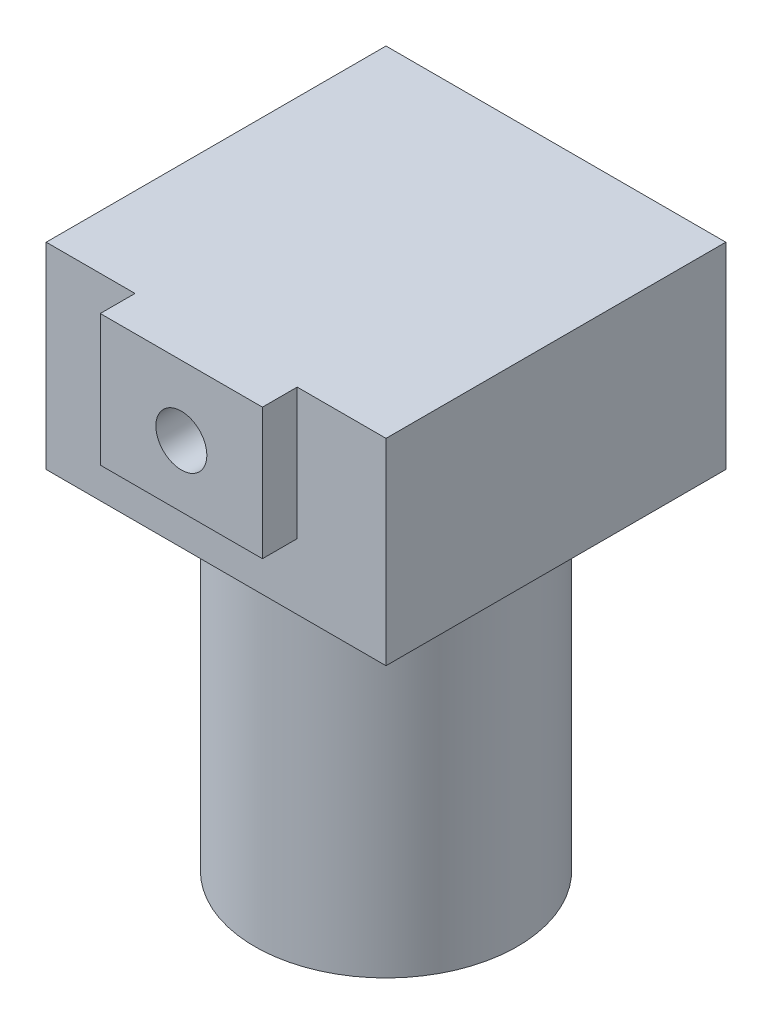
ISO-10303-21;
HEADER;
FILE_DESCRIPTION(('STEP AP214'),'2;1');
FILE_NAME('part.step','',(''),(''),'','','');
FILE_SCHEMA(('AUTOMOTIVE_DESIGN { 1 0 10303 214 1 1 1 1 }'));
ENDSEC;
DATA;
#1=APPLICATION_CONTEXT('core data for automotive mechanical design processes');
#2=APPLICATION_PROTOCOL_DEFINITION('international standard','automotive_design',2000,#1);
#3=PRODUCT_CONTEXT('',#1,'mechanical');
#4=PRODUCT('Part','Part','',(#3));
#5=PRODUCT_RELATED_PRODUCT_CATEGORY('part','',(#4));
#6=PRODUCT_DEFINITION_FORMATION('','',#4);
#7=PRODUCT_DEFINITION_CONTEXT('part definition',#1,'design');
#8=PRODUCT_DEFINITION('design','',#6,#7);
#9=PRODUCT_DEFINITION_SHAPE('','',#8);
#10=(LENGTH_UNIT() NAMED_UNIT(*) SI_UNIT(.MILLI.,.METRE.));
#11=(NAMED_UNIT(*) PLANE_ANGLE_UNIT() SI_UNIT($,.RADIAN.));
#12=(NAMED_UNIT(*) SI_UNIT($,.STERADIAN.) SOLID_ANGLE_UNIT());
#13=UNCERTAINTY_MEASURE_WITH_UNIT(LENGTH_MEASURE(1.E-05),#10,'distance_accuracy_value','');
#14=(GEOMETRIC_REPRESENTATION_CONTEXT(3) GLOBAL_UNCERTAINTY_ASSIGNED_CONTEXT((#13)) GLOBAL_UNIT_ASSIGNED_CONTEXT((#10,
#11,#12)) REPRESENTATION_CONTEXT('',''));
#15=CARTESIAN_POINT('',(0.,0.,0.));
#16=DIRECTION('',(0.,0.,1.));
#17=DIRECTION('',(1.,0.,0.));
#18=AXIS2_PLACEMENT_3D('',#15,#16,#17);
#19=CARTESIAN_POINT('',(0.,25.5,0.));
#20=DIRECTION('',(1.,0.,0.));
#21=DIRECTION('',(0.,0.,-1.));
#22=AXIS2_PLACEMENT_3D('',#19,#20,#21);
#23=PLANE('',#22);
#24=DIRECTION('',(0.,-1.,0.));
#25=VECTOR('',#24,1.);
#26=CARTESIAN_POINT('',(0.,0.,-4.5));
#27=LINE('',#26,#25);
#28=CARTESIAN_POINT('',(0.,25.5,-4.5));
#29=VERTEX_POINT('',#28);
#30=CARTESIAN_POINT('',(0.,0.,-4.5));
#31=VERTEX_POINT('',#30);
#32=EDGE_CURVE('E47',#29,#31,#27,.T.);
#33=ORIENTED_EDGE('',*,*,#32,.F.);
#34=DIRECTION('',(0.,0.,1.));
#35=VECTOR('',#34,1.);
#36=CARTESIAN_POINT('',(0.,25.5,0.));
#37=LINE('',#36,#35);
#38=CARTESIAN_POINT('',(0.,25.5,-48.5));
#39=VERTEX_POINT('',#38);
#40=EDGE_CURVE('E78',#39,#29,#37,.T.);
#41=ORIENTED_EDGE('',*,*,#40,.F.);
#42=DIRECTION('',(0.,-1.,0.));
#43=VECTOR('',#42,1.);
#44=CARTESIAN_POINT('',(0.,25.5,-48.5));
#45=LINE('',#44,#43);
#46=CARTESIAN_POINT('',(0.,0.,-48.5));
#47=VERTEX_POINT('',#46);
#48=EDGE_CURVE('E72',#39,#47,#45,.T.);
#49=ORIENTED_EDGE('',*,*,#48,.T.);
#50=DIRECTION('',(0.,0.,1.));
#51=VECTOR('',#50,1.);
#52=CARTESIAN_POINT('',(0.,0.,0.));
#53=LINE('',#52,#51);
#54=EDGE_CURVE('E83',#47,#31,#53,.T.);
#55=ORIENTED_EDGE('',*,*,#54,.T.);
#56=EDGE_LOOP('',(#33,#41,#49,#55));
#57=FACE_BOUND('',#56,.T.);
#58=ADVANCED_FACE('F32',(#57),#23,.F.);
#59=CARTESIAN_POINT('',(0.,25.5,0.));
#60=DIRECTION('',(0.,0.,-1.));
#61=DIRECTION('',(-1.,0.,0.));
#62=AXIS2_PLACEMENT_3D('',#59,#60,#61);
#63=PLANE('',#62);
#64=CARTESIAN_POINT('',(22.,16.5,0.));
#65=DIRECTION('',(0.,0.,1.));
#66=DIRECTION('',(1.,0.,0.));
#67=AXIS2_PLACEMENT_3D('',#64,#65,#66);
#68=CIRCLE('',#67,3.3);
#69=CARTESIAN_POINT('',(25.3,16.5,0.));
#70=VERTEX_POINT('',#69);
#71=EDGE_CURVE('E136',#70,#70,#68,.T.);
#72=ORIENTED_EDGE('',*,*,#71,.F.);
#73=EDGE_LOOP('',(#72));
#74=FACE_BOUND('',#73,.T.);
#75=DIRECTION('',(0.,-1.,0.));
#76=VECTOR('',#75,1.);
#77=CARTESIAN_POINT('',(11.5,0.,0.));
#78=LINE('',#77,#76);
#79=CARTESIAN_POINT('',(11.5,25.5,0.));
#80=VERTEX_POINT('',#79);
#81=CARTESIAN_POINT('',(11.5,8.5,0.));
#82=VERTEX_POINT('',#81);
#83=EDGE_CURVE('E109',#80,#82,#78,.T.);
#84=ORIENTED_EDGE('',*,*,#83,.T.);
#85=DIRECTION('',(1.,0.,0.));
#86=VECTOR('',#85,1.);
#87=CARTESIAN_POINT('',(0.,8.49999999999999,0.));
#88=LINE('',#87,#86);
#89=CARTESIAN_POINT('',(32.5,8.5,0.));
#90=VERTEX_POINT('',#89);
#91=EDGE_CURVE('E113',#82,#90,#88,.T.);
#92=ORIENTED_EDGE('',*,*,#91,.T.);
#93=DIRECTION('',(0.,-1.,0.));
#94=VECTOR('',#93,1.);
#95=CARTESIAN_POINT('',(32.5,0.,0.));
#96=LINE('',#95,#94);
#97=CARTESIAN_POINT('',(32.5,25.5,0.));
#98=VERTEX_POINT('',#97);
#99=EDGE_CURVE('E116',#98,#90,#96,.T.);
#100=ORIENTED_EDGE('',*,*,#99,.F.);
#101=DIRECTION('',(1.,0.,0.));
#102=VECTOR('',#101,1.);
#103=CARTESIAN_POINT('',(0.,25.5,0.));
#104=LINE('',#103,#102);
#105=EDGE_CURVE('E96',#80,#98,#104,.T.);
#106=ORIENTED_EDGE('',*,*,#105,.F.);
#107=EDGE_LOOP('',(#84,#92,#100,#106));
#108=FACE_BOUND('',#107,.T.);
#109=ADVANCED_FACE('F166',(#74,#108),#63,.F.);
#110=CARTESIAN_POINT('',(44.,25.5,0.));
#111=DIRECTION('',(-1.,0.,0.));
#112=DIRECTION('',(0.,0.,1.));
#113=AXIS2_PLACEMENT_3D('',#110,#111,#112);
#114=PLANE('',#113);
#115=DIRECTION('',(0.,1.,0.));
#116=VECTOR('',#115,1.);
#117=CARTESIAN_POINT('',(44.,0.,-4.5));
#118=LINE('',#117,#116);
#119=CARTESIAN_POINT('',(44.,0.,-4.5));
#120=VERTEX_POINT('',#119);
#121=CARTESIAN_POINT('',(44.,25.5,-4.5));
#122=VERTEX_POINT('',#121);
#123=EDGE_CURVE('E104',#120,#122,#118,.T.);
#124=ORIENTED_EDGE('',*,*,#123,.F.);
#125=DIRECTION('',(0.,0.,-1.));
#126=VECTOR('',#125,1.);
#127=CARTESIAN_POINT('',(44.,0.,0.));
#128=LINE('',#127,#126);
#129=CARTESIAN_POINT('',(44.,0.,-48.5));
#130=VERTEX_POINT('',#129);
#131=EDGE_CURVE('E79',#120,#130,#128,.T.);
#132=ORIENTED_EDGE('',*,*,#131,.T.);
#133=DIRECTION('',(0.,-1.,0.));
#134=VECTOR('',#133,1.);
#135=CARTESIAN_POINT('',(44.,25.5,-48.5));
#136=LINE('',#135,#134);
#137=CARTESIAN_POINT('',(44.,25.5,-48.5));
#138=VERTEX_POINT('',#137);
#139=EDGE_CURVE('E35',#138,#130,#136,.T.);
#140=ORIENTED_EDGE('',*,*,#139,.F.);
#141=DIRECTION('',(0.,0.,-1.));
#142=VECTOR('',#141,1.);
#143=CARTESIAN_POINT('',(44.,25.5,0.));
#144=LINE('',#143,#142);
#145=EDGE_CURVE('E94',#122,#138,#144,.T.);
#146=ORIENTED_EDGE('',*,*,#145,.F.);
#147=EDGE_LOOP('',(#124,#132,#140,#146));
#148=FACE_BOUND('',#147,.T.);
#149=ADVANCED_FACE('F163',(#148),#114,.F.);
#150=CARTESIAN_POINT('',(0.,25.5,0.));
#151=DIRECTION('',(0.,-1.,0.));
#152=DIRECTION('',(0.,0.,-1.));
#153=AXIS2_PLACEMENT_3D('',#150,#151,#152);
#154=PLANE('',#153);
#155=ORIENTED_EDGE('',*,*,#105,.T.);
#156=DIRECTION('',(0.,0.,1.));
#157=VECTOR('',#156,1.);
#158=CARTESIAN_POINT('',(32.5,25.5,-4.5));
#159=LINE('',#158,#157);
#160=CARTESIAN_POINT('',(32.5,25.5,-4.5));
#161=VERTEX_POINT('',#160);
#162=EDGE_CURVE('E100',#161,#98,#159,.T.);
#163=ORIENTED_EDGE('',*,*,#162,.F.);
#164=DIRECTION('',(-1.,0.,0.));
#165=VECTOR('',#164,1.);
#166=CARTESIAN_POINT('',(0.,25.5,-4.5));
#167=LINE('',#166,#165);
#168=EDGE_CURVE('E112',#122,#161,#167,.T.);
#169=ORIENTED_EDGE('',*,*,#168,.F.);
#170=ORIENTED_EDGE('',*,*,#145,.T.);
#171=DIRECTION('',(-1.,0.,0.));
#172=VECTOR('',#171,1.);
#173=CARTESIAN_POINT('',(0.,25.5,-48.5));
#174=LINE('',#173,#172);
#175=EDGE_CURVE('E56',#138,#39,#174,.T.);
#176=ORIENTED_EDGE('',*,*,#175,.T.);
#177=ORIENTED_EDGE('',*,*,#40,.T.);
#178=CARTESIAN_POINT('',(11.5,25.5,-4.5));
#179=VERTEX_POINT('',#178);
#180=EDGE_CURVE('E124',#179,#29,#167,.T.);
#181=ORIENTED_EDGE('',*,*,#180,.F.);
#182=DIRECTION('',(0.,0.,1.));
#183=VECTOR('',#182,1.);
#184=CARTESIAN_POINT('',(11.5,25.5,-4.5));
#185=LINE('',#184,#183);
#186=EDGE_CURVE('E86',#179,#80,#185,.T.);
#187=ORIENTED_EDGE('',*,*,#186,.T.);
#188=EDGE_LOOP('',(#155,#163,#169,#170,#176,#177,#181,#187));
#189=FACE_BOUND('',#188,.T.);
#190=ADVANCED_FACE('F155',(#189),#154,.F.);
#191=CARTESIAN_POINT('',(0.,0.,0.));
#192=DIRECTION('',(0.,-1.,0.));
#193=DIRECTION('',(0.,0.,-1.));
#194=AXIS2_PLACEMENT_3D('',#191,#192,#193);
#195=PLANE('',#194);
#196=CARTESIAN_POINT('',(22.,0.,-26.5));
#197=DIRECTION('',(0.,-1.,0.));
#198=DIRECTION('',(0.,0.,-1.));
#199=AXIS2_PLACEMENT_3D('',#196,#197,#198);
#200=CIRCLE('',#199,17.);
#201=CARTESIAN_POINT('',(22.,0.,-43.5));
#202=VERTEX_POINT('',#201);
#203=EDGE_CURVE('E11',#202,#202,#200,.T.);
#204=ORIENTED_EDGE('',*,*,#203,.F.);
#205=EDGE_LOOP('',(#204));
#206=FACE_BOUND('',#205,.T.);
#207=ORIENTED_EDGE('',*,*,#131,.F.);
#208=DIRECTION('',(1.,0.,0.));
#209=VECTOR('',#208,1.);
#210=CARTESIAN_POINT('',(0.,0.,-4.5));
#211=LINE('',#210,#209);
#212=EDGE_CURVE('E85',#31,#120,#211,.T.);
#213=ORIENTED_EDGE('',*,*,#212,.F.);
#214=ORIENTED_EDGE('',*,*,#54,.F.);
#215=DIRECTION('',(-1.,0.,0.));
#216=VECTOR('',#215,1.);
#217=CARTESIAN_POINT('',(0.,0.,-48.5));
#218=LINE('',#217,#216);
#219=EDGE_CURVE('E69',#130,#47,#218,.T.);
#220=ORIENTED_EDGE('',*,*,#219,.F.);
#221=EDGE_LOOP('',(#207,#213,#214,#220));
#222=FACE_BOUND('',#221,.T.);
#223=ADVANCED_FACE('F84',(#206,#222),#195,.T.);
#224=CARTESIAN_POINT('',(0.,25.5,-48.5));
#225=DIRECTION('',(0.,0.,1.));
#226=DIRECTION('',(1.,0.,0.));
#227=AXIS2_PLACEMENT_3D('',#224,#225,#226);
#228=PLANE('',#227);
#229=ORIENTED_EDGE('',*,*,#219,.T.);
#230=ORIENTED_EDGE('',*,*,#48,.F.);
#231=ORIENTED_EDGE('',*,*,#175,.F.);
#232=ORIENTED_EDGE('',*,*,#139,.T.);
#233=EDGE_LOOP('',(#229,#230,#231,#232));
#234=FACE_BOUND('',#233,.T.);
#235=ADVANCED_FACE('F71',(#234),#228,.F.);
#236=CARTESIAN_POINT('',(11.5,0.,-4.5));
#237=DIRECTION('',(-1.,0.,0.));
#238=DIRECTION('',(0.,-1.,0.));
#239=AXIS2_PLACEMENT_3D('',#236,#237,#238);
#240=PLANE('',#239);
#241=ORIENTED_EDGE('',*,*,#83,.F.);
#242=ORIENTED_EDGE('',*,*,#186,.F.);
#243=DIRECTION('',(0.,-1.,0.));
#244=VECTOR('',#243,1.);
#245=CARTESIAN_POINT('',(11.5,0.,-4.5));
#246=LINE('',#245,#244);
#247=CARTESIAN_POINT('',(11.5,8.5,-4.5));
#248=VERTEX_POINT('',#247);
#249=EDGE_CURVE('E125',#179,#248,#246,.T.);
#250=ORIENTED_EDGE('',*,*,#249,.T.);
#251=DIRECTION('',(0.,0.,1.));
#252=VECTOR('',#251,1.);
#253=CARTESIAN_POINT('',(11.5,8.5,-4.5));
#254=LINE('',#253,#252);
#255=EDGE_CURVE('E90',#248,#82,#254,.T.);
#256=ORIENTED_EDGE('',*,*,#255,.T.);
#257=EDGE_LOOP('',(#241,#242,#250,#256));
#258=FACE_BOUND('',#257,.T.);
#259=ADVANCED_FACE('F161',(#258),#240,.T.);
#260=CARTESIAN_POINT('',(0.,8.49999999999999,-4.5));
#261=DIRECTION('',(0.,-1.,0.));
#262=DIRECTION('',(1.,0.,0.));
#263=AXIS2_PLACEMENT_3D('',#260,#261,#262);
#264=PLANE('',#263);
#265=ORIENTED_EDGE('',*,*,#91,.F.);
#266=ORIENTED_EDGE('',*,*,#255,.F.);
#267=DIRECTION('',(1.,0.,0.));
#268=VECTOR('',#267,1.);
#269=CARTESIAN_POINT('',(0.,8.49999999999999,-4.5));
#270=LINE('',#269,#268);
#271=CARTESIAN_POINT('',(32.5,8.5,-4.5));
#272=VERTEX_POINT('',#271);
#273=EDGE_CURVE('E128',#248,#272,#270,.T.);
#274=ORIENTED_EDGE('',*,*,#273,.T.);
#275=DIRECTION('',(0.,0.,1.));
#276=VECTOR('',#275,1.);
#277=CARTESIAN_POINT('',(32.5,8.5,-4.5));
#278=LINE('',#277,#276);
#279=EDGE_CURVE('E103',#272,#90,#278,.T.);
#280=ORIENTED_EDGE('',*,*,#279,.T.);
#281=EDGE_LOOP('',(#265,#266,#274,#280));
#282=FACE_BOUND('',#281,.T.);
#283=ADVANCED_FACE('F209',(#282),#264,.T.);
#284=CARTESIAN_POINT('',(32.5,0.,-4.5));
#285=DIRECTION('',(-1.,0.,0.));
#286=DIRECTION('',(0.,0.,1.));
#287=AXIS2_PLACEMENT_3D('',#284,#285,#286);
#288=PLANE('',#287);
#289=ORIENTED_EDGE('',*,*,#99,.T.);
#290=ORIENTED_EDGE('',*,*,#279,.F.);
#291=DIRECTION('',(0.,-1.,0.));
#292=VECTOR('',#291,1.);
#293=CARTESIAN_POINT('',(32.5,0.,-4.5));
#294=LINE('',#293,#292);
#295=EDGE_CURVE('E131',#161,#272,#294,.T.);
#296=ORIENTED_EDGE('',*,*,#295,.F.);
#297=ORIENTED_EDGE('',*,*,#162,.T.);
#298=EDGE_LOOP('',(#289,#290,#296,#297));
#299=FACE_BOUND('',#298,.T.);
#300=ADVANCED_FACE('F213',(#299),#288,.F.);
#301=CARTESIAN_POINT('',(0.,0.,-4.5));
#302=DIRECTION('',(0.,0.,1.));
#303=DIRECTION('',(1.,0.,0.));
#304=AXIS2_PLACEMENT_3D('',#301,#302,#303);
#305=PLANE('',#304);
#306=ORIENTED_EDGE('',*,*,#168,.T.);
#307=ORIENTED_EDGE('',*,*,#295,.T.);
#308=ORIENTED_EDGE('',*,*,#273,.F.);
#309=ORIENTED_EDGE('',*,*,#249,.F.);
#310=ORIENTED_EDGE('',*,*,#180,.T.);
#311=ORIENTED_EDGE('',*,*,#32,.T.);
#312=ORIENTED_EDGE('',*,*,#212,.T.);
#313=ORIENTED_EDGE('',*,*,#123,.T.);
#314=EDGE_LOOP('',(#306,#307,#308,#309,#310,#311,#312,#313));
#315=FACE_BOUND('',#314,.T.);
#316=ADVANCED_FACE('F198',(#315),#305,.T.);
#317=CARTESIAN_POINT('',(22.,16.5,-7.));
#318=DIRECTION('',(0.,0.,1.));
#319=DIRECTION('',(1.,0.,0.));
#320=AXIS2_PLACEMENT_3D('',#317,#318,#319);
#321=CYLINDRICAL_SURFACE('',#320,3.3);
#322=CARTESIAN_POINT('',(22.,16.5,-7.));
#323=DIRECTION('',(0.,0.,1.));
#324=DIRECTION('',(1.,0.,0.));
#325=AXIS2_PLACEMENT_3D('',#322,#323,#324);
#326=CIRCLE('',#325,3.3);
#327=CARTESIAN_POINT('',(25.3,16.5,-7.));
#328=VERTEX_POINT('',#327);
#329=EDGE_CURVE('E119',#328,#328,#326,.T.);
#330=ORIENTED_EDGE('',*,*,#329,.F.);
#331=EDGE_LOOP('',(#330));
#332=FACE_BOUND('',#331,.T.);
#333=ORIENTED_EDGE('',*,*,#71,.T.);
#334=EDGE_LOOP('',(#333));
#335=FACE_BOUND('',#334,.T.);
#336=ADVANCED_FACE('F225',(#332,#335),#321,.F.);
#337=CARTESIAN_POINT('',(22.,16.5,-7.));
#338=DIRECTION('',(0.,0.,1.));
#339=DIRECTION('',(1.,0.,0.));
#340=AXIS2_PLACEMENT_3D('',#337,#338,#339);
#341=PLANE('',#340);
#342=ORIENTED_EDGE('',*,*,#329,.T.);
#343=EDGE_LOOP('',(#342));
#344=FACE_BOUND('',#343,.T.);
#345=ADVANCED_FACE('F150',(#344),#341,.T.);
#346=CARTESIAN_POINT('',(22.,-45.,-26.5));
#347=DIRECTION('',(0.,1.,0.));
#348=DIRECTION('',(0.,0.,1.));
#349=AXIS2_PLACEMENT_3D('',#346,#347,#348);
#350=CYLINDRICAL_SURFACE('',#349,17.);
#351=CARTESIAN_POINT('',(22.,-45.,-26.5));
#352=DIRECTION('',(0.,-1.,0.));
#353=DIRECTION('',(0.,0.,-1.));
#354=AXIS2_PLACEMENT_3D('',#351,#352,#353);
#355=CIRCLE('',#354,17.);
#356=CARTESIAN_POINT('',(22.,-45.,-43.5));
#357=VERTEX_POINT('',#356);
#358=EDGE_CURVE('E139',#357,#357,#355,.T.);
#359=ORIENTED_EDGE('',*,*,#358,.F.);
#360=EDGE_LOOP('',(#359));
#361=FACE_BOUND('',#360,.T.);
#362=ORIENTED_EDGE('',*,*,#203,.T.);
#363=EDGE_LOOP('',(#362));
#364=FACE_BOUND('',#363,.T.);
#365=ADVANCED_FACE('F147',(#361,#364),#350,.T.);
#366=CARTESIAN_POINT('',(22.,-45.,-26.5));
#367=DIRECTION('',(0.,-1.,0.));
#368=DIRECTION('',(0.,0.,-1.));
#369=AXIS2_PLACEMENT_3D('',#366,#367,#368);
#370=PLANE('',#369);
#371=ORIENTED_EDGE('',*,*,#358,.T.);
#372=EDGE_LOOP('',(#371));
#373=FACE_BOUND('',#372,.T.);
#374=ADVANCED_FACE('F145',(#373),#370,.T.);
#375=CLOSED_SHELL('',(#58,#109,#149,#190,#223,#235,#259,#283,#300,#316,#336,#345,#365,#374));
#376=MANIFOLD_SOLID_BREP('B2',#375);
#377=ADVANCED_BREP_SHAPE_REPRESENTATION('',(#18,#376),#14);
#378=SHAPE_DEFINITION_REPRESENTATION(#9,#377);
ENDSEC;
END-ISO-10303-21;
